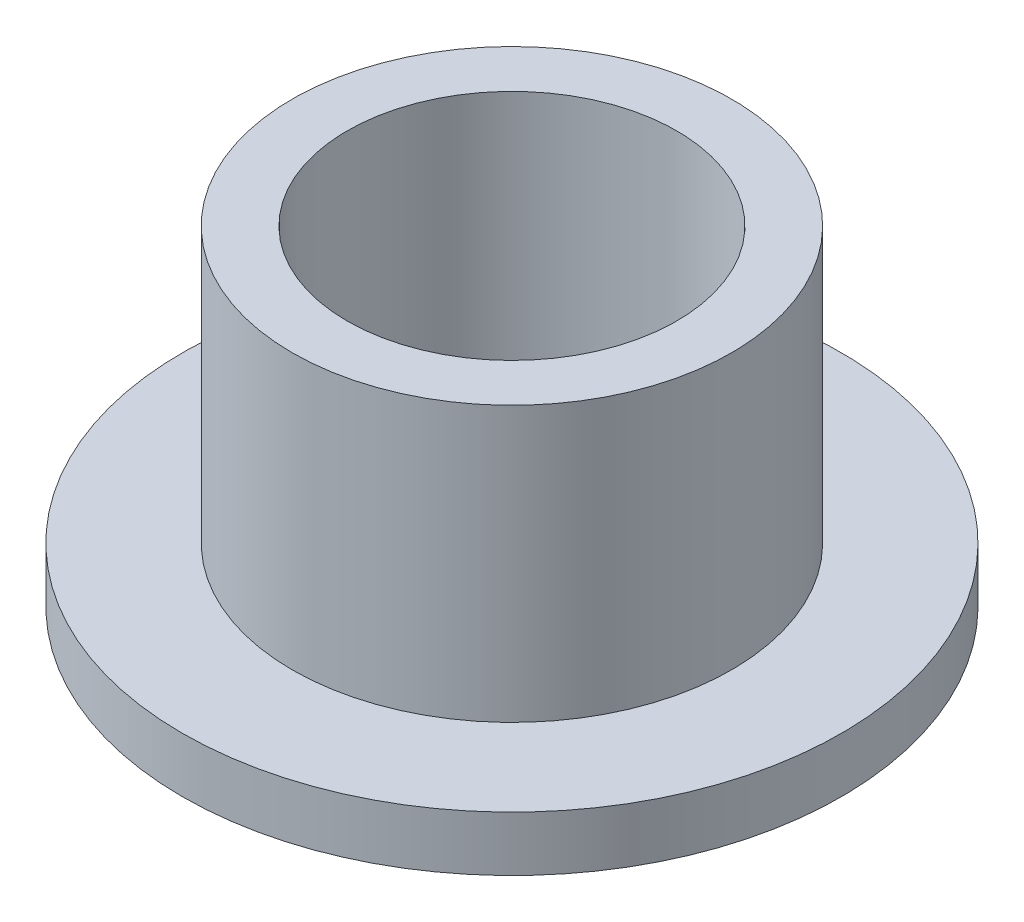
ISO-10303-21;
HEADER;
FILE_DESCRIPTION(('STEP AP214'),'2;1');
FILE_NAME('part.step','',(''),(''),'','','');
FILE_SCHEMA(('AUTOMOTIVE_DESIGN { 1 0 10303 214 1 1 1 1 }'));
ENDSEC;
DATA;
#1=APPLICATION_CONTEXT('core data for automotive mechanical design processes');
#2=APPLICATION_PROTOCOL_DEFINITION('international standard','automotive_design',2000,#1);
#3=PRODUCT_CONTEXT('',#1,'mechanical');
#4=PRODUCT('Part','Part','',(#3));
#5=PRODUCT_RELATED_PRODUCT_CATEGORY('part','',(#4));
#6=PRODUCT_DEFINITION_FORMATION('','',#4);
#7=PRODUCT_DEFINITION_CONTEXT('part definition',#1,'design');
#8=PRODUCT_DEFINITION('design','',#6,#7);
#9=PRODUCT_DEFINITION_SHAPE('','',#8);
#10=(LENGTH_UNIT() NAMED_UNIT(*) SI_UNIT(.MILLI.,.METRE.));
#11=(NAMED_UNIT(*) PLANE_ANGLE_UNIT() SI_UNIT($,.RADIAN.));
#12=(NAMED_UNIT(*) SI_UNIT($,.STERADIAN.) SOLID_ANGLE_UNIT());
#13=UNCERTAINTY_MEASURE_WITH_UNIT(LENGTH_MEASURE(1.E-05),#10,'distance_accuracy_value','');
#14=(GEOMETRIC_REPRESENTATION_CONTEXT(3) GLOBAL_UNCERTAINTY_ASSIGNED_CONTEXT((#13)) GLOBAL_UNIT_ASSIGNED_CONTEXT((#10,
#11,#12)) REPRESENTATION_CONTEXT('',''));
#15=CARTESIAN_POINT('',(0.,0.,0.));
#16=DIRECTION('',(0.,0.,1.));
#17=DIRECTION('',(1.,0.,0.));
#18=AXIS2_PLACEMENT_3D('',#15,#16,#17);
#19=CARTESIAN_POINT('',(0.,6.,0.));
#20=DIRECTION('',(0.,1.,0.));
#21=DIRECTION('',(0.,0.,1.));
#22=AXIS2_PLACEMENT_3D('',#19,#20,#21);
#23=PLANE('',#22);
#24=CARTESIAN_POINT('',(0.,6.,0.));
#25=DIRECTION('',(0.,1.,0.));
#26=DIRECTION('',(0.,0.,1.));
#27=AXIS2_PLACEMENT_3D('',#24,#25,#26);
#28=CIRCLE('',#27,4.);
#29=CARTESIAN_POINT('',(0.,6.,4.));
#30=VERTEX_POINT('',#29);
#31=EDGE_CURVE('E10',#30,#30,#28,.T.);
#32=ORIENTED_EDGE('',*,*,#31,.T.);
#33=EDGE_LOOP('',(#32));
#34=FACE_BOUND('',#33,.T.);
#35=CARTESIAN_POINT('',(0.,6.,0.));
#36=DIRECTION('',(0.,1.,0.));
#37=DIRECTION('',(0.,0.,1.));
#38=AXIS2_PLACEMENT_3D('',#35,#36,#37);
#39=CIRCLE('',#38,3.);
#40=CARTESIAN_POINT('',(0.,6.,3.));
#41=VERTEX_POINT('',#40);
#42=EDGE_CURVE('E40',#41,#41,#39,.T.);
#43=ORIENTED_EDGE('',*,*,#42,.F.);
#44=EDGE_LOOP('',(#43));
#45=FACE_BOUND('',#44,.T.);
#46=ADVANCED_FACE('F33',(#34,#45),#23,.T.);
#47=CARTESIAN_POINT('',(0.,0.,0.));
#48=DIRECTION('',(0.,1.,0.));
#49=DIRECTION('',(0.,0.,1.));
#50=AXIS2_PLACEMENT_3D('',#47,#48,#49);
#51=PLANE('',#50);
#52=CARTESIAN_POINT('',(0.,0.,0.));
#53=DIRECTION('',(0.,1.,0.));
#54=DIRECTION('',(0.,0.,1.));
#55=AXIS2_PLACEMENT_3D('',#52,#53,#54);
#56=CIRCLE('',#55,3.);
#57=CARTESIAN_POINT('',(0.,0.,3.));
#58=VERTEX_POINT('',#57);
#59=EDGE_CURVE('E44',#58,#58,#56,.T.);
#60=ORIENTED_EDGE('',*,*,#59,.T.);
#61=EDGE_LOOP('',(#60));
#62=FACE_BOUND('',#61,.T.);
#63=CARTESIAN_POINT('',(0.,0.,0.));
#64=DIRECTION('',(0.,1.,0.));
#65=DIRECTION('',(0.,0.,1.));
#66=AXIS2_PLACEMENT_3D('',#63,#64,#65);
#67=CIRCLE('',#66,6.);
#68=CARTESIAN_POINT('',(0.,0.,6.));
#69=VERTEX_POINT('',#68);
#70=EDGE_CURVE('E51',#69,#69,#67,.T.);
#71=ORIENTED_EDGE('',*,*,#70,.F.);
#72=EDGE_LOOP('',(#71));
#73=FACE_BOUND('',#72,.T.);
#74=ADVANCED_FACE('F76',(#62,#73),#51,.F.);
#75=CARTESIAN_POINT('',(0.,6.,0.));
#76=DIRECTION('',(0.,-1.,0.));
#77=DIRECTION('',(0.,0.,-1.));
#78=AXIS2_PLACEMENT_3D('',#75,#76,#77);
#79=CYLINDRICAL_SURFACE('',#78,4.);
#80=CARTESIAN_POINT('',(0.,1.,0.));
#81=DIRECTION('',(0.,1.,0.));
#82=DIRECTION('',(0.,0.,1.));
#83=AXIS2_PLACEMENT_3D('',#80,#81,#82);
#84=CIRCLE('',#83,4.);
#85=CARTESIAN_POINT('',(0.,1.,4.));
#86=VERTEX_POINT('',#85);
#87=EDGE_CURVE('E54',#86,#86,#84,.T.);
#88=ORIENTED_EDGE('',*,*,#87,.T.);
#89=EDGE_LOOP('',(#88));
#90=FACE_BOUND('',#89,.T.);
#91=ORIENTED_EDGE('',*,*,#31,.F.);
#92=EDGE_LOOP('',(#91));
#93=FACE_BOUND('',#92,.T.);
#94=ADVANCED_FACE('F35',(#90,#93),#79,.T.);
#95=CARTESIAN_POINT('',(0.,6.,0.));
#96=DIRECTION('',(0.,-1.,0.));
#97=DIRECTION('',(0.,0.,-1.));
#98=AXIS2_PLACEMENT_3D('',#95,#96,#97);
#99=CYLINDRICAL_SURFACE('',#98,3.);
#100=ORIENTED_EDGE('',*,*,#42,.T.);
#101=EDGE_LOOP('',(#100));
#102=FACE_BOUND('',#101,.T.);
#103=ORIENTED_EDGE('',*,*,#59,.F.);
#104=EDGE_LOOP('',(#103));
#105=FACE_BOUND('',#104,.T.);
#106=ADVANCED_FACE('F65',(#102,#105),#99,.F.);
#107=CARTESIAN_POINT('',(0.,1.,0.));
#108=DIRECTION('',(0.,1.,0.));
#109=DIRECTION('',(0.,0.,1.));
#110=AXIS2_PLACEMENT_3D('',#107,#108,#109);
#111=PLANE('',#110);
#112=CARTESIAN_POINT('',(0.,1.,0.));
#113=DIRECTION('',(0.,1.,0.));
#114=DIRECTION('',(0.,0.,1.));
#115=AXIS2_PLACEMENT_3D('',#112,#113,#114);
#116=CIRCLE('',#115,6.);
#117=CARTESIAN_POINT('',(0.,1.,6.));
#118=VERTEX_POINT('',#117);
#119=EDGE_CURVE('E49',#118,#118,#116,.T.);
#120=ORIENTED_EDGE('',*,*,#119,.T.);
#121=EDGE_LOOP('',(#120));
#122=FACE_BOUND('',#121,.T.);
#123=ORIENTED_EDGE('',*,*,#87,.F.);
#124=EDGE_LOOP('',(#123));
#125=FACE_BOUND('',#124,.T.);
#126=ADVANCED_FACE('F62',(#122,#125),#111,.T.);
#127=CARTESIAN_POINT('',(0.,1.,0.));
#128=DIRECTION('',(0.,-1.,0.));
#129=DIRECTION('',(0.,0.,-1.));
#130=AXIS2_PLACEMENT_3D('',#127,#128,#129);
#131=CYLINDRICAL_SURFACE('',#130,6.);
#132=ORIENTED_EDGE('',*,*,#119,.F.);
#133=EDGE_LOOP('',(#132));
#134=FACE_BOUND('',#133,.T.);
#135=ORIENTED_EDGE('',*,*,#70,.T.);
#136=EDGE_LOOP('',(#135));
#137=FACE_BOUND('',#136,.T.);
#138=ADVANCED_FACE('F64',(#134,#137),#131,.T.);
#139=CLOSED_SHELL('',(#46,#74,#94,#106,#126,#138));
#140=MANIFOLD_SOLID_BREP('B2',#139);
#141=ADVANCED_BREP_SHAPE_REPRESENTATION('',(#18,#140),#14);
#142=SHAPE_DEFINITION_REPRESENTATION(#9,#141);
ENDSEC;
END-ISO-10303-21;
